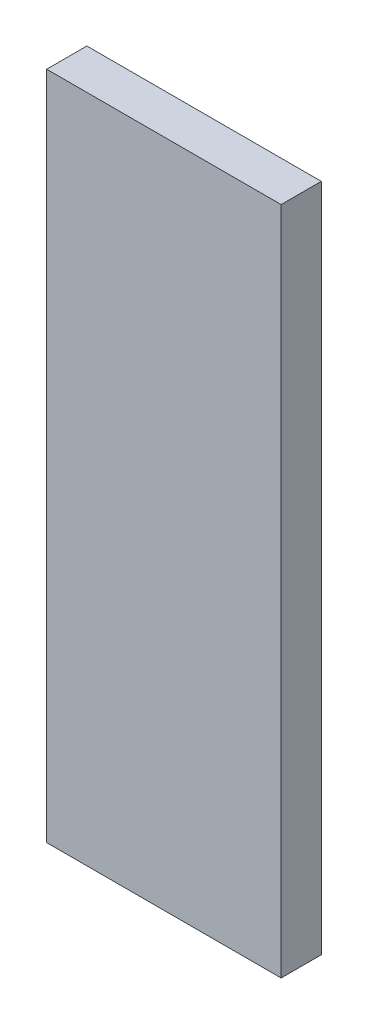
ISO-10303-21;
HEADER;
FILE_DESCRIPTION(('STEP AP214'),'2;1');
FILE_NAME('part.step','',(''),(''),'','','');
FILE_SCHEMA(('AUTOMOTIVE_DESIGN { 1 0 10303 214 1 1 1 1 }'));
ENDSEC;
DATA;
#1=APPLICATION_CONTEXT('core data for automotive mechanical design processes');
#2=APPLICATION_PROTOCOL_DEFINITION('international standard','automotive_design',2000,#1);
#3=PRODUCT_CONTEXT('',#1,'mechanical');
#4=PRODUCT('Part','Part','',(#3));
#5=PRODUCT_RELATED_PRODUCT_CATEGORY('part','',(#4));
#6=PRODUCT_DEFINITION_FORMATION('','',#4);
#7=PRODUCT_DEFINITION_CONTEXT('part definition',#1,'design');
#8=PRODUCT_DEFINITION('design','',#6,#7);
#9=PRODUCT_DEFINITION_SHAPE('','',#8);
#10=(LENGTH_UNIT() NAMED_UNIT(*) SI_UNIT(.MILLI.,.METRE.));
#11=(NAMED_UNIT(*) PLANE_ANGLE_UNIT() SI_UNIT($,.RADIAN.));
#12=(NAMED_UNIT(*) SI_UNIT($,.STERADIAN.) SOLID_ANGLE_UNIT());
#13=UNCERTAINTY_MEASURE_WITH_UNIT(LENGTH_MEASURE(1.E-05),#10,'distance_accuracy_value','');
#14=(GEOMETRIC_REPRESENTATION_CONTEXT(3) GLOBAL_UNCERTAINTY_ASSIGNED_CONTEXT((#13)) GLOBAL_UNIT_ASSIGNED_CONTEXT((#10,
#11,#12)) REPRESENTATION_CONTEXT('',''));
#15=CARTESIAN_POINT('',(0.,0.,0.));
#16=DIRECTION('',(0.,0.,1.));
#17=DIRECTION('',(1.,0.,0.));
#18=AXIS2_PLACEMENT_3D('',#15,#16,#17);
#19=CARTESIAN_POINT('',(-8.75,25.,3.));
#20=DIRECTION('',(1.,0.,0.));
#21=DIRECTION('',(0.,1.,0.));
#22=AXIS2_PLACEMENT_3D('',#19,#20,#21);
#23=PLANE('',#22);
#24=DIRECTION('',(0.,-1.,0.));
#25=VECTOR('',#24,1.);
#26=CARTESIAN_POINT('',(-8.75,25.,0.));
#27=LINE('',#26,#25);
#28=CARTESIAN_POINT('',(-8.75,25.,0.));
#29=VERTEX_POINT('',#28);
#30=CARTESIAN_POINT('',(-8.74999999999999,-25.,0.));
#31=VERTEX_POINT('',#30);
#32=EDGE_CURVE('E107',#29,#31,#27,.T.);
#33=ORIENTED_EDGE('',*,*,#32,.T.);
#34=DIRECTION('',(0.,0.,-1.));
#35=VECTOR('',#34,1.);
#36=CARTESIAN_POINT('',(-8.74999999999999,-25.,3.));
#37=LINE('',#36,#35);
#38=CARTESIAN_POINT('',(-8.74999999999999,-25.,3.));
#39=VERTEX_POINT('',#38);
#40=EDGE_CURVE('E11',#39,#31,#37,.T.);
#41=ORIENTED_EDGE('',*,*,#40,.F.);
#42=DIRECTION('',(0.,-1.,0.));
#43=VECTOR('',#42,1.);
#44=CARTESIAN_POINT('',(-8.75,25.,3.));
#45=LINE('',#44,#43);
#46=CARTESIAN_POINT('',(-8.75,25.,3.));
#47=VERTEX_POINT('',#46);
#48=EDGE_CURVE('E91',#47,#39,#45,.T.);
#49=ORIENTED_EDGE('',*,*,#48,.F.);
#50=DIRECTION('',(0.,0.,-1.));
#51=VECTOR('',#50,1.);
#52=CARTESIAN_POINT('',(-8.75,25.,3.));
#53=LINE('',#52,#51);
#54=EDGE_CURVE('E103',#47,#29,#53,.T.);
#55=ORIENTED_EDGE('',*,*,#54,.T.);
#56=EDGE_LOOP('',(#33,#41,#49,#55));
#57=FACE_BOUND('',#56,.T.);
#58=ADVANCED_FACE('F39',(#57),#23,.F.);
#59=CARTESIAN_POINT('',(8.75000000000001,-25.,3.));
#60=DIRECTION('',(0.,1.,0.));
#61=DIRECTION('',(-1.,0.,0.));
#62=AXIS2_PLACEMENT_3D('',#59,#60,#61);
#63=PLANE('',#62);
#64=DIRECTION('',(1.,0.,0.));
#65=VECTOR('',#64,1.);
#66=CARTESIAN_POINT('',(8.75000000000001,-25.,0.));
#67=LINE('',#66,#65);
#68=CARTESIAN_POINT('',(8.75000000000001,-25.,0.));
#69=VERTEX_POINT('',#68);
#70=EDGE_CURVE('E96',#31,#69,#67,.T.);
#71=ORIENTED_EDGE('',*,*,#70,.T.);
#72=DIRECTION('',(0.,0.,-1.));
#73=VECTOR('',#72,1.);
#74=CARTESIAN_POINT('',(8.75000000000001,-25.,3.));
#75=LINE('',#74,#73);
#76=CARTESIAN_POINT('',(8.75000000000001,-25.,3.));
#77=VERTEX_POINT('',#76);
#78=EDGE_CURVE('E48',#77,#69,#75,.T.);
#79=ORIENTED_EDGE('',*,*,#78,.F.);
#80=DIRECTION('',(1.,0.,0.));
#81=VECTOR('',#80,1.);
#82=CARTESIAN_POINT('',(8.75000000000001,-25.,3.));
#83=LINE('',#82,#81);
#84=EDGE_CURVE('E86',#39,#77,#83,.T.);
#85=ORIENTED_EDGE('',*,*,#84,.F.);
#86=ORIENTED_EDGE('',*,*,#40,.T.);
#87=EDGE_LOOP('',(#71,#79,#85,#86));
#88=FACE_BOUND('',#87,.T.);
#89=ADVANCED_FACE('F95',(#88),#63,.F.);
#90=CARTESIAN_POINT('',(8.75,25.,3.));
#91=DIRECTION('',(-1.,0.,0.));
#92=DIRECTION('',(0.,-1.,0.));
#93=AXIS2_PLACEMENT_3D('',#90,#91,#92);
#94=PLANE('',#93);
#95=DIRECTION('',(0.,1.,0.));
#96=VECTOR('',#95,1.);
#97=CARTESIAN_POINT('',(8.75,25.,0.));
#98=LINE('',#97,#96);
#99=CARTESIAN_POINT('',(8.75,25.,0.));
#100=VERTEX_POINT('',#99);
#101=EDGE_CURVE('E73',#69,#100,#98,.T.);
#102=ORIENTED_EDGE('',*,*,#101,.T.);
#103=DIRECTION('',(0.,0.,-1.));
#104=VECTOR('',#103,1.);
#105=CARTESIAN_POINT('',(8.75,25.,3.));
#106=LINE('',#105,#104);
#107=CARTESIAN_POINT('',(8.75,25.,3.));
#108=VERTEX_POINT('',#107);
#109=EDGE_CURVE('E98',#108,#100,#106,.T.);
#110=ORIENTED_EDGE('',*,*,#109,.F.);
#111=DIRECTION('',(0.,1.,0.));
#112=VECTOR('',#111,1.);
#113=CARTESIAN_POINT('',(8.75,25.,3.));
#114=LINE('',#113,#112);
#115=EDGE_CURVE('E89',#77,#108,#114,.T.);
#116=ORIENTED_EDGE('',*,*,#115,.F.);
#117=ORIENTED_EDGE('',*,*,#78,.T.);
#118=EDGE_LOOP('',(#102,#110,#116,#117));
#119=FACE_BOUND('',#118,.T.);
#120=ADVANCED_FACE('F99',(#119),#94,.F.);
#121=CARTESIAN_POINT('',(8.75,25.,3.));
#122=DIRECTION('',(0.,-1.,0.));
#123=DIRECTION('',(0.,0.,-1.));
#124=AXIS2_PLACEMENT_3D('',#121,#122,#123);
#125=PLANE('',#124);
#126=DIRECTION('',(-1.,0.,0.));
#127=VECTOR('',#126,1.);
#128=CARTESIAN_POINT('',(8.75,25.,0.));
#129=LINE('',#128,#127);
#130=EDGE_CURVE('E79',#100,#29,#129,.T.);
#131=ORIENTED_EDGE('',*,*,#130,.T.);
#132=ORIENTED_EDGE('',*,*,#54,.F.);
#133=DIRECTION('',(-1.,0.,0.));
#134=VECTOR('',#133,1.);
#135=CARTESIAN_POINT('',(8.75,25.,3.));
#136=LINE('',#135,#134);
#137=EDGE_CURVE('E56',#108,#47,#136,.T.);
#138=ORIENTED_EDGE('',*,*,#137,.F.);
#139=ORIENTED_EDGE('',*,*,#109,.T.);
#140=EDGE_LOOP('',(#131,#132,#138,#139));
#141=FACE_BOUND('',#140,.T.);
#142=ADVANCED_FACE('F120',(#141),#125,.F.);
#143=CARTESIAN_POINT('',(0.,0.,3.));
#144=DIRECTION('',(0.,0.,-1.));
#145=DIRECTION('',(-1.,0.,0.));
#146=AXIS2_PLACEMENT_3D('',#143,#144,#145);
#147=PLANE('',#146);
#148=ORIENTED_EDGE('',*,*,#48,.T.);
#149=ORIENTED_EDGE('',*,*,#84,.T.);
#150=ORIENTED_EDGE('',*,*,#115,.T.);
#151=ORIENTED_EDGE('',*,*,#137,.T.);
#152=EDGE_LOOP('',(#148,#149,#150,#151));
#153=FACE_BOUND('',#152,.T.);
#154=ADVANCED_FACE('F87',(#153),#147,.F.);
#155=CARTESIAN_POINT('',(0.,0.,0.));
#156=DIRECTION('',(0.,0.,-1.));
#157=DIRECTION('',(-1.,0.,0.));
#158=AXIS2_PLACEMENT_3D('',#155,#156,#157);
#159=PLANE('',#158);
#160=ORIENTED_EDGE('',*,*,#32,.F.);
#161=ORIENTED_EDGE('',*,*,#130,.F.);
#162=ORIENTED_EDGE('',*,*,#101,.F.);
#163=ORIENTED_EDGE('',*,*,#70,.F.);
#164=EDGE_LOOP('',(#160,#161,#162,#163));
#165=FACE_BOUND('',#164,.T.);
#166=ADVANCED_FACE('F123',(#165),#159,.T.);
#167=CLOSED_SHELL('',(#58,#89,#120,#142,#154,#166));
#168=MANIFOLD_SOLID_BREP('B2',#167);
#169=ADVANCED_BREP_SHAPE_REPRESENTATION('',(#18,#168),#14);
#170=SHAPE_DEFINITION_REPRESENTATION(#9,#169);
ENDSEC;
END-ISO-10303-21;
